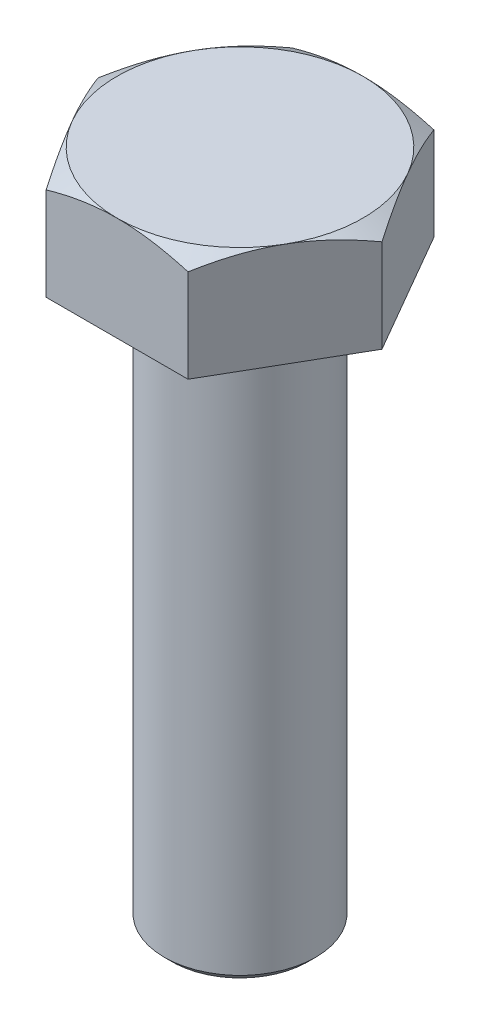
ISO-10303-21;
HEADER;
FILE_DESCRIPTION(('STEP AP214'),'2;1');
FILE_NAME('part.step','',(''),(''),'','','');
FILE_SCHEMA(('AUTOMOTIVE_DESIGN { 1 0 10303 214 1 1 1 1 }'));
ENDSEC;
DATA;
#1=APPLICATION_CONTEXT('core data for automotive mechanical design processes');
#2=APPLICATION_PROTOCOL_DEFINITION('international standard','automotive_design',2000,#1);
#3=PRODUCT_CONTEXT('',#1,'mechanical');
#4=PRODUCT('Part','Part','',(#3));
#5=PRODUCT_RELATED_PRODUCT_CATEGORY('part','',(#4));
#6=PRODUCT_DEFINITION_FORMATION('','',#4);
#7=PRODUCT_DEFINITION_CONTEXT('part definition',#1,'design');
#8=PRODUCT_DEFINITION('design','',#6,#7);
#9=PRODUCT_DEFINITION_SHAPE('','',#8);
#10=(LENGTH_UNIT() NAMED_UNIT(*) SI_UNIT(.MILLI.,.METRE.));
#11=(NAMED_UNIT(*) PLANE_ANGLE_UNIT() SI_UNIT($,.RADIAN.));
#12=(NAMED_UNIT(*) SI_UNIT($,.STERADIAN.) SOLID_ANGLE_UNIT());
#13=UNCERTAINTY_MEASURE_WITH_UNIT(LENGTH_MEASURE(1.E-05),#10,'distance_accuracy_value','');
#14=(GEOMETRIC_REPRESENTATION_CONTEXT(3) GLOBAL_UNCERTAINTY_ASSIGNED_CONTEXT((#13)) GLOBAL_UNIT_ASSIGNED_CONTEXT((#10,
#11,#12)) REPRESENTATION_CONTEXT('',''));
#15=CARTESIAN_POINT('',(0.,0.,0.));
#16=DIRECTION('',(0.,0.,1.));
#17=DIRECTION('',(1.,0.,0.));
#18=AXIS2_PLACEMENT_3D('',#15,#16,#17);
#19=CARTESIAN_POINT('',(-7.50555349946513,5.5,0.));
#20=DIRECTION('',(0.866025403784439,0.,-0.5));
#21=DIRECTION('',(-0.5,0.,-0.866025403784439));
#22=AXIS2_PLACEMENT_3D('',#19,#20,#21);
#23=PLANE('',#22);
#24=DIRECTION('',(0.,-1.,0.));
#25=VECTOR('',#24,1.);
#26=CARTESIAN_POINT('',(-3.75277674973257,5.5,6.5));
#27=LINE('',#26,#25);
#28=CARTESIAN_POINT('',(-3.75277674973257,4.91944341639923,6.5));
#29=VERTEX_POINT('',#28);
#30=CARTESIAN_POINT('',(-3.75277674973257,0.,6.5));
#31=VERTEX_POINT('',#30);
#32=EDGE_CURVE('E215',#29,#31,#27,.T.);
#33=ORIENTED_EDGE('',*,*,#32,.F.);
#34=CARTESIAN_POINT('',(-3.75266127967873,4.91937674819413,6.5002));
#35=CARTESIAN_POINT('',(-3.8351516191275,4.96699557692451,6.35732254094112));
#36=CARTESIAN_POINT('',(-3.91794952254312,5.01245329939729,6.21391236546509));
#37=CARTESIAN_POINT('',(-4.08421773795795,5.09845131797695,5.9259273686828));
#38=CARTESIAN_POINT('',(-4.16768832359105,5.13898949277197,5.78135207342873));
#39=CARTESIAN_POINT('',(-4.41943655294051,5.25242899887679,5.34531134947996));
#40=CARTESIAN_POINT('',(-4.58870793403689,5.31695219287126,5.05212471715368));
#41=CARTESIAN_POINT('',(-4.84201947708215,5.39261341645251,4.61337625445562));
#42=CARTESIAN_POINT('',(-4.92530276780316,5.41416714354301,4.46912536350531));
#43=CARTESIAN_POINT('',(-5.09224566542477,5.45030968539388,4.17997178286191));
#44=CARTESIAN_POINT('',(-5.17590523841627,5.46489911554033,4.03506915190111));
#45=CARTESIAN_POINT('',(-5.34336968579964,5.48674124749265,3.74501222057168));
#46=CARTESIAN_POINT('',(-5.427174286676,5.49400227567789,3.59985839394579));
#47=CARTESIAN_POINT('',(-5.59485627940484,5.50103969741777,3.30942466302505));
#48=CARTESIAN_POINT('',(-5.6787336689286,5.5008163221878,3.16414476276364));
#49=CARTESIAN_POINT('',(-5.90853103021317,5.48991654148483,2.7661240575735));
#50=CARTESIAN_POINT('',(-6.05437578112763,5.47161818213059,2.51351353897243));
#51=CARTESIAN_POINT('',(-6.34509659313134,5.41359365854233,2.00997032176432));
#52=CARTESIAN_POINT('',(-6.48997163178544,5.37384766146176,1.75903939406691));
#53=CARTESIAN_POINT('',(-6.78127752911038,5.27449409679785,1.25448277935568));
#54=CARTESIAN_POINT('',(-6.92767163007067,5.21446557436197,1.00092075856408));
#55=CARTESIAN_POINT('',(-7.21827667013276,5.07822500749013,0.497578064240954));
#56=CARTESIAN_POINT('',(-7.36249133098588,5.0020449658364,0.247790944447035));
#57=CARTESIAN_POINT('',(-7.50566896951897,4.91937674819413,-0.000200000000000198));
#58=B_SPLINE_CURVE_WITH_KNOTS('',3,(#34,#35,#36,#37,#38,#39,#40,#41,#42,#43,#44,#45,#46,#47,#48,
#49,#50,#51,#52,#53,#54,#55,#56,#57),.UNSPECIFIED.,.F.,.F.,(4,2,2,2,2,2,2,2,2,2,2,4),(0.,
0.515105052395589,1.03043143507525,2.06322554824263,2.56697389547997,3.07067772176454,
3.57380860368928,4.0769239424252,4.9527935470566,5.82947446853466,6.72559912449736,
7.61996451221046),.UNSPECIFIED.);
#59=CARTESIAN_POINT('',(-5.62916512459885,5.5,3.25));
#60=VERTEX_POINT('',#59);
#61=EDGE_CURVE('E109',#29,#60,#58,.T.);
#62=ORIENTED_EDGE('',*,*,#61,.T.);
#63=CARTESIAN_POINT('',(-7.50555349946513,4.91944341639923,0.));
#64=VERTEX_POINT('',#63);
#65=EDGE_CURVE('E48',#60,#64,#58,.T.);
#66=ORIENTED_EDGE('',*,*,#65,.T.);
#67=DIRECTION('',(0.,-1.,0.));
#68=VECTOR('',#67,1.);
#69=CARTESIAN_POINT('',(-7.50555349946513,5.5,0.));
#70=LINE('',#69,#68);
#71=CARTESIAN_POINT('',(-7.50555349946513,0.,0.));
#72=VERTEX_POINT('',#71);
#73=EDGE_CURVE('E210',#64,#72,#70,.T.);
#74=ORIENTED_EDGE('',*,*,#73,.T.);
#75=DIRECTION('',(0.5,0.,0.866025403784439));
#76=VECTOR('',#75,1.);
#77=CARTESIAN_POINT('',(-7.50555349946513,0.,0.));
#78=LINE('',#77,#76);
#79=EDGE_CURVE('E258',#72,#31,#78,.T.);
#80=ORIENTED_EDGE('',*,*,#79,.T.);
#81=EDGE_LOOP('',(#33,#62,#66,#74,#80));
#82=FACE_BOUND('',#81,.T.);
#83=ADVANCED_FACE('F32',(#82),#23,.F.);
#84=CARTESIAN_POINT('',(-3.75277674973257,5.5,6.5));
#85=DIRECTION('',(0.,0.,-1.));
#86=DIRECTION('',(-1.,0.,0.));
#87=AXIS2_PLACEMENT_3D('',#84,#85,#86);
#88=PLANE('',#87);
#89=DIRECTION('',(0.,-1.,0.));
#90=VECTOR('',#89,1.);
#91=CARTESIAN_POINT('',(3.75277674973256,5.5,6.5));
#92=LINE('',#91,#90);
#93=CARTESIAN_POINT('',(3.75277674973256,4.91944341639923,6.5));
#94=VERTEX_POINT('',#93);
#95=CARTESIAN_POINT('',(3.75277674973256,0.,6.5));
#96=VERTEX_POINT('',#95);
#97=EDGE_CURVE('E132',#94,#96,#92,.T.);
#98=ORIENTED_EDGE('',*,*,#97,.F.);
#99=CARTESIAN_POINT('',(-10.2569811581145,2.24193603747567,6.5));
#100=CARTESIAN_POINT('',(-9.97152071241616,2.3811107260564,6.5));
#101=CARTESIAN_POINT('',(-9.68542356184238,2.51900094901753,6.5));
#102=CARTESIAN_POINT('',(-9.11161784295799,2.79149330549847,6.5));
#103=CARTESIAN_POINT('',(-8.82390904413647,2.92609495309311,6.5));
#104=CARTESIAN_POINT('',(-8.24514298507913,3.19193071680512,6.5));
#105=CARTESIAN_POINT('',(-7.95407611612472,3.32314398250626,6.5));
#106=CARTESIAN_POINT('',(-7.36968788076824,3.58043061920346,6.5));
#107=CARTESIAN_POINT('',(-7.07636661672063,3.70650422193208,6.5));
#108=CARTESIAN_POINT('',(-6.47695243590429,3.95634962963028,6.5));
#109=CARTESIAN_POINT('',(-6.17076515690619,4.07989623181881,6.5));
#110=CARTESIAN_POINT('',(-5.55487406233115,4.31805921645203,6.5));
#111=CARTESIAN_POINT('',(-5.24516986632689,4.43267462205472,6.5));
#112=CARTESIAN_POINT('',(-4.62227782859011,4.65009578142601,6.5));
#113=CARTESIAN_POINT('',(-4.30909789509134,4.75292397660159,6.5));
#114=CARTESIAN_POINT('',(-3.67824562128558,4.94358764514793,6.5));
#115=CARTESIAN_POINT('',(-3.36057467243283,5.03142765666299,6.5));
#116=CARTESIAN_POINT('',(-2.72233834322949,5.18755382777747,6.5));
#117=CARTESIAN_POINT('',(-2.40180034569074,5.25595018727147,6.5));
#118=CARTESIAN_POINT('',(-1.75651446089022,5.36942603167775,6.5));
#119=CARTESIAN_POINT('',(-1.43176704086645,5.41450808209729,6.5));
#120=CARTESIAN_POINT('',(-0.944948454223624,5.461661214171,6.5));
#121=CARTESIAN_POINT('',(-0.783829121847983,5.47395132499534,6.5));
#122=CARTESIAN_POINT('',(-0.461207643956623,5.49170569978557,6.5));
#123=CARTESIAN_POINT('',(-0.299705505129459,5.49717008214536,6.5));
#124=CARTESIAN_POINT('',(0.0233847507870482,5.5011346278911,6.5));
#125=CARTESIAN_POINT('',(0.184972868293144,5.49963475720699,6.5));
#126=CARTESIAN_POINT('',(0.507938624093218,5.48971122482812,6.5));
#127=CARTESIAN_POINT('',(0.669316252561588,5.48128725074041,6.5));
#128=CARTESIAN_POINT('',(1.05186984116705,5.45329242106935,6.5));
#129=CARTESIAN_POINT('',(1.27283197400475,5.43073050256622,6.5));
#130=CARTESIAN_POINT('',(1.7132204140684,5.3738163776728,6.5));
#131=CARTESIAN_POINT('',(1.93264652850567,5.33946271742277,6.5));
#132=CARTESIAN_POINT('',(2.5883051727522,5.22052726609204,6.5));
#133=CARTESIAN_POINT('',(3.02170523211321,5.12008872652817,6.5));
#134=CARTESIAN_POINT('',(3.67013226717754,4.94455981713671,6.5));
#135=CARTESIAN_POINT('',(3.88848282118767,4.88102933682177,6.5));
#136=CARTESIAN_POINT('',(4.32306650384689,4.74703310722731,6.5));
#137=CARTESIAN_POINT('',(4.53929961593337,4.67656730374728,6.5));
#138=CARTESIAN_POINT('',(4.96971257662596,4.52985876558726,6.5));
#139=CARTESIAN_POINT('',(5.18389297179377,4.45361761968216,6.5));
#140=CARTESIAN_POINT('',(5.6104545614491,4.29628899088769,6.5));
#141=CARTESIAN_POINT('',(5.82283579881262,4.21520162386241,6.5));
#142=CARTESIAN_POINT('',(6.39971429617937,3.98860660424242,6.5));
#143=CARTESIAN_POINT('',(6.76263661829908,3.83909295608597,6.5));
#144=CARTESIAN_POINT('',(7.48468774337365,3.53113759508195,6.5));
#145=CARTESIAN_POINT('',(7.84381610059947,3.37269484676216,6.5));
#146=CARTESIAN_POINT('',(8.55916159829325,3.04901713597798,6.5));
#147=CARTESIAN_POINT('',(8.91537751556308,2.88377947937219,6.5));
#148=CARTESIAN_POINT('',(9.62534833847638,2.54815535258062,6.5));
#149=CARTESIAN_POINT('',(9.97910334857499,2.37776910259174,6.5));
#150=CARTESIAN_POINT('',(10.6852305173667,2.03269430481302,6.5));
#151=CARTESIAN_POINT('',(11.0375994152368,1.8579990986413,6.5));
#152=CARTESIAN_POINT('',(11.7407393222631,1.50541985688161,6.5));
#153=CARTESIAN_POINT('',(12.0915103173944,1.32753579337205,6.5));
#154=CARTESIAN_POINT('',(12.7916615383492,0.969252159931259,6.5));
#155=CARTESIAN_POINT('',(13.1410420664163,0.788853179925624,6.5));
#156=CARTESIAN_POINT('',(13.8387213322387,0.425974163130967,6.5));
#157=CARTESIAN_POINT('',(14.1870200656207,0.243494117942694,6.5));
#158=CARTESIAN_POINT('',(15.155733527584,-0.26705759309495,6.5));
#159=CARTESIAN_POINT('',(15.7751675029438,-0.596989701899075,6.5));
#160=CARTESIAN_POINT('',(17.0119683749366,-1.26079214349704,6.5));
#161=CARTESIAN_POINT('',(17.6293351357113,-1.59466272885168,6.5));
#162=CARTESIAN_POINT('',(18.8603569569557,-2.26417235282034,6.5));
#163=CARTESIAN_POINT('',(19.4740174800252,-2.59980135723137,6.5));
#164=CARTESIAN_POINT('',(20.7000468035059,-3.27329318403227,6.5));
#165=CARTESIAN_POINT('',(21.3124157052552,-3.61115582187028,6.5));
#166=CARTESIAN_POINT('',(21.9243328758051,-3.94982870082288,6.5));
#167=B_SPLINE_CURVE_WITH_KNOTS('',3,(#99,#100,#101,#102,#103,#104,#105,#106,#107,#108,#109,#110,
#111,#112,#113,#114,#115,#116,#117,#118,#119,#120,#121,#122,#123,#124,#125,#126,#127,#128,#129,
#130,#131,#132,#133,#134,#135,#136,#137,#138,#139,#140,#141,#142,#143,#144,#145,#146,#147,#148,
#149,#150,#151,#152,#153,#154,#155,#156,#157,#158,#159,#160,#161,#162,#163,#164,#165,#166),
.UNSPECIFIED.,.F.,.F.,(4,2,2,2,2,2,2,2,2,2,2,2,2,2,2,2,2,2,2,2,2,2,2,2,2,2,2,2,2,2,2,2,2,4),(0.,
0.952751787332591,1.9056435136375,2.86343013145144,3.82117351756361,4.81158577818519,
5.80210621269642,6.79070834510604,7.77901061389342,8.76159445926533,9.74407015806365,
10.2287097693575,10.7133409743435,11.1979745502116,11.6826299923647,12.3485906881873,
13.0146335229724,14.3473568128282,15.0295101923764,15.7116689034696,16.3936406320568,
17.0755960624924,18.2529569542351,19.4304546619183,20.6084238291587,21.7863426877004,
22.96621250542,24.1460926591093,25.3257005550144,26.5053132135446,28.6107561283309,
30.7163347998396,32.814670367307,34.9128346761895),.UNSPECIFIED.);
#168=CARTESIAN_POINT('',(0.,5.5,6.5));
#169=VERTEX_POINT('',#168);
#170=EDGE_CURVE('E113',#94,#169,#167,.F.);
#171=ORIENTED_EDGE('',*,*,#170,.T.);
#172=EDGE_CURVE('E103',#169,#29,#167,.F.);
#173=ORIENTED_EDGE('',*,*,#172,.T.);
#174=ORIENTED_EDGE('',*,*,#32,.T.);
#175=DIRECTION('',(1.,0.,0.));
#176=VECTOR('',#175,1.);
#177=CARTESIAN_POINT('',(-3.75277674973257,0.,6.5));
#178=LINE('',#177,#176);
#179=EDGE_CURVE('E262',#31,#96,#178,.T.);
#180=ORIENTED_EDGE('',*,*,#179,.T.);
#181=EDGE_LOOP('',(#98,#171,#173,#174,#180));
#182=FACE_BOUND('',#181,.T.);
#183=ADVANCED_FACE('F130',(#182),#88,.F.);
#184=CARTESIAN_POINT('',(3.75277674973256,5.5,6.5));
#185=DIRECTION('',(-0.866025403784439,0.,-0.5));
#186=DIRECTION('',(-0.5,0.,0.866025403784439));
#187=AXIS2_PLACEMENT_3D('',#184,#185,#186);
#188=PLANE('',#187);
#189=DIRECTION('',(0.,-1.,0.));
#190=VECTOR('',#189,1.);
#191=CARTESIAN_POINT('',(7.50555349946513,5.5,0.));
#192=LINE('',#191,#190);
#193=CARTESIAN_POINT('',(7.50555349946513,4.91944341639924,0.));
#194=VERTEX_POINT('',#193);
#195=CARTESIAN_POINT('',(7.50555349946513,0.,0.));
#196=VERTEX_POINT('',#195);
#197=EDGE_CURVE('E206',#194,#196,#192,.T.);
#198=ORIENTED_EDGE('',*,*,#197,.F.);
#199=CARTESIAN_POINT('',(7.50566896951897,4.91937674819413,-0.000200000000002157));
#200=CARTESIAN_POINT('',(7.42317863007019,4.96699557692451,0.142677459058878));
#201=CARTESIAN_POINT('',(7.34038072665458,5.01245329939729,0.28608763453491));
#202=CARTESIAN_POINT('',(7.17411251123975,5.09845131797695,0.574072631317192));
#203=CARTESIAN_POINT('',(7.09064192560665,5.13898949277197,0.718647926571262));
#204=CARTESIAN_POINT('',(6.83889369625718,5.25242899887679,1.15468865052003));
#205=CARTESIAN_POINT('',(6.6696223151608,5.31695219287126,1.44787528284632));
#206=CARTESIAN_POINT('',(6.41631077211555,5.39261341645251,1.88662374554437));
#207=CARTESIAN_POINT('',(6.33302748139454,5.41416714354301,2.03087463649469));
#208=CARTESIAN_POINT('',(6.16608458377293,5.45030968539388,2.32002821713809));
#209=CARTESIAN_POINT('',(6.08242501078142,5.46489911554034,2.46493084809889));
#210=CARTESIAN_POINT('',(5.91496056339806,5.48674124749266,2.75498777942832));
#211=CARTESIAN_POINT('',(5.8311559625217,5.49400227567789,2.90014160605421));
#212=CARTESIAN_POINT('',(5.66347396979286,5.50103969741777,3.19057533697495));
#213=CARTESIAN_POINT('',(5.5795965802691,5.5008163221878,3.33585523723636));
#214=CARTESIAN_POINT('',(5.34979921898453,5.48991654148484,3.7338759424265));
#215=CARTESIAN_POINT('',(5.20395446807006,5.47161818213059,3.98648646102757));
#216=CARTESIAN_POINT('',(4.91323365606635,5.41359365854233,4.49002967823568));
#217=CARTESIAN_POINT('',(4.76835861741225,5.37384766146176,4.74096060593308));
#218=CARTESIAN_POINT('',(4.47705272008731,5.27449409679785,5.24551722064432));
#219=CARTESIAN_POINT('',(4.33065861912702,5.21446557436197,5.49907924143591));
#220=CARTESIAN_POINT('',(4.04005357906493,5.07822500749013,6.00242193575905));
#221=CARTESIAN_POINT('',(3.89583891821181,5.0020449658364,6.25220905555296));
#222=CARTESIAN_POINT('',(3.75266127967873,4.91937674819413,6.5002));
#223=B_SPLINE_CURVE_WITH_KNOTS('',3,(#199,#200,#201,#202,#203,#204,#205,#206,#207,#208,#209,
#210,#211,#212,#213,#214,#215,#216,#217,#218,#219,#220,#221,#222),.UNSPECIFIED.,.F.,.F.,(4,2,2,
2,2,2,2,2,2,2,2,4),(0.,0.515105052395588,1.03043143507525,2.06322554824263,2.56697389547997,
3.07067772176454,3.57380860368928,4.0769239424252,4.9527935470566,5.82947446853467,
6.72559912449737,7.61996451221046),.UNSPECIFIED.);
#224=CARTESIAN_POINT('',(5.62916512459885,5.5,3.25));
#225=VERTEX_POINT('',#224);
#226=EDGE_CURVE('E263',#194,#225,#223,.T.);
#227=ORIENTED_EDGE('',*,*,#226,.T.);
#228=EDGE_CURVE('E121',#225,#94,#223,.T.);
#229=ORIENTED_EDGE('',*,*,#228,.T.);
#230=ORIENTED_EDGE('',*,*,#97,.T.);
#231=DIRECTION('',(0.5,0.,-0.866025403784439));
#232=VECTOR('',#231,1.);
#233=CARTESIAN_POINT('',(3.75277674973256,0.,6.5));
#234=LINE('',#233,#232);
#235=EDGE_CURVE('E264',#96,#196,#234,.T.);
#236=ORIENTED_EDGE('',*,*,#235,.T.);
#237=EDGE_LOOP('',(#198,#227,#229,#230,#236));
#238=FACE_BOUND('',#237,.T.);
#239=ADVANCED_FACE('F158',(#238),#188,.F.);
#240=CARTESIAN_POINT('',(7.50555349946513,5.5,0.));
#241=DIRECTION('',(-0.866025403784438,0.,0.5));
#242=DIRECTION('',(0.5,0.,0.866025403784439));
#243=AXIS2_PLACEMENT_3D('',#240,#241,#242);
#244=PLANE('',#243);
#245=DIRECTION('',(0.,-1.,0.));
#246=VECTOR('',#245,1.);
#247=CARTESIAN_POINT('',(3.75277674973256,5.5,-6.5));
#248=LINE('',#247,#246);
#249=CARTESIAN_POINT('',(3.75277674973256,4.91944341639923,-6.5));
#250=VERTEX_POINT('',#249);
#251=CARTESIAN_POINT('',(3.75277674973256,0.,-6.5));
#252=VERTEX_POINT('',#251);
#253=EDGE_CURVE('E200',#250,#252,#248,.T.);
#254=ORIENTED_EDGE('',*,*,#253,.F.);
#255=CARTESIAN_POINT('',(3.75266127967872,4.91937674819413,-6.5002));
#256=CARTESIAN_POINT('',(3.8351516191275,4.96699557692451,-6.35732254094112));
#257=CARTESIAN_POINT('',(3.91794952254312,5.01245329939729,-6.21391236546509));
#258=CARTESIAN_POINT('',(4.08421773795794,5.09845131797695,-5.9259273686828));
#259=CARTESIAN_POINT('',(4.16768832359105,5.13898949277197,-5.78135207342874));
#260=CARTESIAN_POINT('',(4.41943655294051,5.25242899887679,-5.34531134947996));
#261=CARTESIAN_POINT('',(4.58870793403689,5.31695219287126,-5.05212471715368));
#262=CARTESIAN_POINT('',(4.84201947708215,5.39261341645251,-4.61337625445563));
#263=CARTESIAN_POINT('',(4.92530276780315,5.41416714354301,-4.46912536350531));
#264=CARTESIAN_POINT('',(5.09224566542477,5.45030968539388,-4.17997178286191));
#265=CARTESIAN_POINT('',(5.17590523841627,5.46489911554034,-4.03506915190111));
#266=CARTESIAN_POINT('',(5.34336968579963,5.48674124749266,-3.74501222057168));
#267=CARTESIAN_POINT('',(5.42717428667599,5.49400227567789,-3.59985839394579));
#268=CARTESIAN_POINT('',(5.59485627940483,5.50103969741777,-3.30942466302505));
#269=CARTESIAN_POINT('',(5.6787336689286,5.5008163221878,-3.16414476276364));
#270=CARTESIAN_POINT('',(5.90853103021317,5.48991654148484,-2.76612405757351));
#271=CARTESIAN_POINT('',(6.05437578112763,5.47161818213059,-2.51351353897243));
#272=CARTESIAN_POINT('',(6.34509659313134,5.41359365854233,-2.00997032176432));
#273=CARTESIAN_POINT('',(6.48997163178544,5.37384766146176,-1.75903939406692));
#274=CARTESIAN_POINT('',(6.78127752911038,5.27449409679785,-1.25448277935568));
#275=CARTESIAN_POINT('',(6.92767163007067,5.21446557436197,-1.00092075856409));
#276=CARTESIAN_POINT('',(7.21827667013276,5.07822500749013,-0.497578064240957));
#277=CARTESIAN_POINT('',(7.36249133098588,5.00204496583641,-0.247790944447038));
#278=CARTESIAN_POINT('',(7.50566896951897,4.91937674819413,0.000199999999998293));
#279=B_SPLINE_CURVE_WITH_KNOTS('',3,(#255,#256,#257,#258,#259,#260,#261,#262,#263,#264,#265,
#266,#267,#268,#269,#270,#271,#272,#273,#274,#275,#276,#277,#278),.UNSPECIFIED.,.F.,.F.,(4,2,2,
2,2,2,2,2,2,2,2,4),(0.,0.515105052395588,1.03043143507525,2.06322554824263,2.56697389547997,
3.07067772176454,3.57380860368928,4.0769239424252,4.9527935470566,5.82947446853466,
6.72559912449736,7.61996451221046),.UNSPECIFIED.);
#280=CARTESIAN_POINT('',(5.62916512459885,5.5,-3.25));
#281=VERTEX_POINT('',#280);
#282=EDGE_CURVE('E114',#250,#281,#279,.T.);
#283=ORIENTED_EDGE('',*,*,#282,.T.);
#284=EDGE_CURVE('E133',#281,#194,#279,.T.);
#285=ORIENTED_EDGE('',*,*,#284,.T.);
#286=ORIENTED_EDGE('',*,*,#197,.T.);
#287=DIRECTION('',(-0.5,0.,-0.866025403784439));
#288=VECTOR('',#287,1.);
#289=CARTESIAN_POINT('',(7.50555349946513,0.,0.));
#290=LINE('',#289,#288);
#291=EDGE_CURVE('E202',#196,#252,#290,.T.);
#292=ORIENTED_EDGE('',*,*,#291,.T.);
#293=EDGE_LOOP('',(#254,#283,#285,#286,#292));
#294=FACE_BOUND('',#293,.T.);
#295=ADVANCED_FACE('F186',(#294),#244,.F.);
#296=CARTESIAN_POINT('',(3.75277674973256,5.5,-6.5));
#297=DIRECTION('',(0.,0.,1.));
#298=DIRECTION('',(1.,0.,0.));
#299=AXIS2_PLACEMENT_3D('',#296,#297,#298);
#300=PLANE('',#299);
#301=DIRECTION('',(0.,-1.,0.));
#302=VECTOR('',#301,1.);
#303=CARTESIAN_POINT('',(-3.75277674973257,5.5,-6.5));
#304=LINE('',#303,#302);
#305=CARTESIAN_POINT('',(-3.75277674973257,4.91944341639923,-6.5));
#306=VERTEX_POINT('',#305);
#307=CARTESIAN_POINT('',(-3.75277674973257,0.,-6.5));
#308=VERTEX_POINT('',#307);
#309=EDGE_CURVE('E207',#306,#308,#304,.T.);
#310=ORIENTED_EDGE('',*,*,#309,.F.);
#311=CARTESIAN_POINT('',(-10.2569811581145,2.24193603747566,-6.5));
#312=CARTESIAN_POINT('',(-9.97152071241616,2.3811107260564,-6.5));
#313=CARTESIAN_POINT('',(-9.68542356184238,2.51900094901753,-6.5));
#314=CARTESIAN_POINT('',(-9.11161784295799,2.79149330549847,-6.5));
#315=CARTESIAN_POINT('',(-8.82390904413647,2.92609495309311,-6.5));
#316=CARTESIAN_POINT('',(-8.24514298507913,3.19193071680512,-6.5));
#317=CARTESIAN_POINT('',(-7.95407611612472,3.32314398250626,-6.5));
#318=CARTESIAN_POINT('',(-7.36968788076824,3.58043061920346,-6.5));
#319=CARTESIAN_POINT('',(-7.07636661672063,3.70650422193208,-6.5));
#320=CARTESIAN_POINT('',(-6.47695243590429,3.95634962963027,-6.5));
#321=CARTESIAN_POINT('',(-6.17076515690619,4.07989623181881,-6.5));
#322=CARTESIAN_POINT('',(-5.55487406233115,4.31805921645203,-6.5));
#323=CARTESIAN_POINT('',(-5.2451698663269,4.43267462205471,-6.5));
#324=CARTESIAN_POINT('',(-4.62227782859012,4.65009578142601,-6.5));
#325=CARTESIAN_POINT('',(-4.30909789509134,4.75292397660159,-6.5));
#326=CARTESIAN_POINT('',(-3.67824562128559,4.94358764514793,-6.5));
#327=CARTESIAN_POINT('',(-3.36057467243283,5.03142765666299,-6.5));
#328=CARTESIAN_POINT('',(-2.72233834322949,5.18755382777747,-6.5));
#329=CARTESIAN_POINT('',(-2.40180034569074,5.25595018727147,-6.5));
#330=CARTESIAN_POINT('',(-1.75651446089022,5.36942603167775,-6.5));
#331=CARTESIAN_POINT('',(-1.43176704086646,5.41450808209729,-6.5));
#332=CARTESIAN_POINT('',(-0.944948454223626,5.461661214171,-6.5));
#333=CARTESIAN_POINT('',(-0.783829121847985,5.47395132499534,-6.5));
#334=CARTESIAN_POINT('',(-0.461207643956625,5.49170569978557,-6.5));
#335=CARTESIAN_POINT('',(-0.29970550512946,5.49717008214536,-6.5));
#336=CARTESIAN_POINT('',(0.0233847507870477,5.5011346278911,-6.5));
#337=CARTESIAN_POINT('',(0.184972868293143,5.49963475720699,-6.5));
#338=CARTESIAN_POINT('',(0.507938624093217,5.48971122482812,-6.5));
#339=CARTESIAN_POINT('',(0.669316252561588,5.48128725074041,-6.5));
#340=CARTESIAN_POINT('',(1.05186984116705,5.45329242106935,-6.5));
#341=CARTESIAN_POINT('',(1.27283197400475,5.43073050256622,-6.5));
#342=CARTESIAN_POINT('',(1.7132204140684,5.3738163776728,-6.5));
#343=CARTESIAN_POINT('',(1.93264652850567,5.33946271742277,-6.5));
#344=CARTESIAN_POINT('',(2.5883051727522,5.22052726609204,-6.5));
#345=CARTESIAN_POINT('',(3.02170523211321,5.12008872652817,-6.5));
#346=CARTESIAN_POINT('',(3.67013226717754,4.94455981713671,-6.5));
#347=CARTESIAN_POINT('',(3.88848282118766,4.88102933682177,-6.5));
#348=CARTESIAN_POINT('',(4.32306650384689,4.74703310722731,-6.5));
#349=CARTESIAN_POINT('',(4.53929961593337,4.67656730374728,-6.5));
#350=CARTESIAN_POINT('',(4.96971257662595,4.52985876558726,-6.5));
#351=CARTESIAN_POINT('',(5.18389297179376,4.45361761968216,-6.5));
#352=CARTESIAN_POINT('',(5.6104545614491,4.29628899088769,-6.5));
#353=CARTESIAN_POINT('',(5.82283579881262,4.21520162386241,-6.5));
#354=CARTESIAN_POINT('',(6.39971429617937,3.98860660424242,-6.5));
#355=CARTESIAN_POINT('',(6.76263661829908,3.83909295608598,-6.5));
#356=CARTESIAN_POINT('',(7.48468774337364,3.53113759508195,-6.5));
#357=CARTESIAN_POINT('',(7.84381610059947,3.37269484676216,-6.5));
#358=CARTESIAN_POINT('',(8.55916159829325,3.04901713597798,-6.5));
#359=CARTESIAN_POINT('',(8.91537751556308,2.88377947937219,-6.5));
#360=CARTESIAN_POINT('',(9.62534833847638,2.54815535258062,-6.5));
#361=CARTESIAN_POINT('',(9.97910334857499,2.37776910259174,-6.5));
#362=CARTESIAN_POINT('',(10.6852305173667,2.03269430481302,-6.5));
#363=CARTESIAN_POINT('',(11.0375994152368,1.8579990986413,-6.5));
#364=CARTESIAN_POINT('',(11.7407393222631,1.50541985688161,-6.5));
#365=CARTESIAN_POINT('',(12.0915103173944,1.32753579337206,-6.5));
#366=CARTESIAN_POINT('',(12.7916615383492,0.969252159931262,-6.5));
#367=CARTESIAN_POINT('',(13.1410420664163,0.788853179925627,-6.5));
#368=CARTESIAN_POINT('',(13.8387213322387,0.425974163130971,-6.5));
#369=CARTESIAN_POINT('',(14.1870200656207,0.243494117942697,-6.5));
#370=CARTESIAN_POINT('',(15.155733527584,-0.267057593094945,-6.5));
#371=CARTESIAN_POINT('',(15.7751675029438,-0.596989701899072,-6.5));
#372=CARTESIAN_POINT('',(17.0119683749366,-1.26079214349704,-6.5));
#373=CARTESIAN_POINT('',(17.6293351357113,-1.59466272885168,-6.5));
#374=CARTESIAN_POINT('',(18.8603569569557,-2.26417235282033,-6.5));
#375=CARTESIAN_POINT('',(19.4740174800252,-2.59980135723136,-6.5));
#376=CARTESIAN_POINT('',(20.7000468035059,-3.27329318403227,-6.5));
#377=CARTESIAN_POINT('',(21.3124157052552,-3.61115582187027,-6.5));
#378=CARTESIAN_POINT('',(21.9243328758051,-3.94982870082287,-6.5));
#379=B_SPLINE_CURVE_WITH_KNOTS('',3,(#311,#312,#313,#314,#315,#316,#317,#318,#319,#320,#321,
#322,#323,#324,#325,#326,#327,#328,#329,#330,#331,#332,#333,#334,#335,#336,#337,#338,#339,#340,
#341,#342,#343,#344,#345,#346,#347,#348,#349,#350,#351,#352,#353,#354,#355,#356,#357,#358,#359,
#360,#361,#362,#363,#364,#365,#366,#367,#368,#369,#370,#371,#372,#373,#374,#375,#376,#377,#378),
.UNSPECIFIED.,.F.,.F.,(4,2,2,2,2,2,2,2,2,2,2,2,2,2,2,2,2,2,2,2,2,2,2,2,2,2,2,2,2,2,2,2,2,4),(0.,
0.952751787332594,1.9056435136375,2.86343013145144,3.82117351756361,4.81158577818519,
5.80210621269642,6.79070834510604,7.77901061389342,8.76159445926533,9.74407015806365,
10.2287097693575,10.7133409743435,11.1979745502116,11.6826299923647,12.3485906881873,
13.0146335229724,14.3473568128282,15.0295101923764,15.7116689034696,16.3936406320568,
17.0755960624924,18.2529569542351,19.4304546619183,20.6084238291587,21.7863426877004,
22.96621250542,24.1460926591092,25.3257005550144,26.5053132135446,28.6107561283309,
30.7163347998396,32.814670367307,34.9128346761895),.UNSPECIFIED.);
#380=CARTESIAN_POINT('',(0.,5.5,-6.5));
#381=VERTEX_POINT('',#380);
#382=EDGE_CURVE('E168',#306,#381,#379,.T.);
#383=ORIENTED_EDGE('',*,*,#382,.T.);
#384=EDGE_CURVE('E176',#381,#250,#379,.T.);
#385=ORIENTED_EDGE('',*,*,#384,.T.);
#386=ORIENTED_EDGE('',*,*,#253,.T.);
#387=DIRECTION('',(-1.,0.,0.));
#388=VECTOR('',#387,1.);
#389=CARTESIAN_POINT('',(3.75277674973256,0.,-6.5));
#390=LINE('',#389,#388);
#391=EDGE_CURVE('E270',#252,#308,#390,.T.);
#392=ORIENTED_EDGE('',*,*,#391,.T.);
#393=EDGE_LOOP('',(#310,#383,#385,#386,#392));
#394=FACE_BOUND('',#393,.T.);
#395=ADVANCED_FACE('F182',(#394),#300,.F.);
#396=CARTESIAN_POINT('',(-3.75277674973257,5.5,-6.5));
#397=DIRECTION('',(0.866025403784439,0.,0.5));
#398=DIRECTION('',(0.5,0.,-0.866025403784439));
#399=AXIS2_PLACEMENT_3D('',#396,#397,#398);
#400=PLANE('',#399);
#401=ORIENTED_EDGE('',*,*,#73,.F.);
#402=CARTESIAN_POINT('',(-7.50566896951897,4.91937674819413,0.0002));
#403=CARTESIAN_POINT('',(-7.42317863007019,4.96699557692451,-0.14267745905888));
#404=CARTESIAN_POINT('',(-7.34038072665458,5.01245329939729,-0.286087634534913));
#405=CARTESIAN_POINT('',(-7.17411251123975,5.09845131797695,-0.574072631317196));
#406=CARTESIAN_POINT('',(-7.09064192560665,5.13898949277197,-0.718647926571265));
#407=CARTESIAN_POINT('',(-6.83889369625718,5.25242899887679,-1.15468865052004));
#408=CARTESIAN_POINT('',(-6.6696223151608,5.31695219287126,-1.44787528284632));
#409=CARTESIAN_POINT('',(-6.41631077211555,5.39261341645251,-1.88662374554438));
#410=CARTESIAN_POINT('',(-6.33302748139454,5.41416714354301,-2.03087463649469));
#411=CARTESIAN_POINT('',(-6.16608458377293,5.45030968539388,-2.32002821713809));
#412=CARTESIAN_POINT('',(-6.08242501078142,5.46489911554033,-2.46493084809889));
#413=CARTESIAN_POINT('',(-5.91496056339806,5.48674124749265,-2.75498777942832));
#414=CARTESIAN_POINT('',(-5.8311559625217,5.49400227567789,-2.90014160605421));
#415=CARTESIAN_POINT('',(-5.66347396979286,5.50103969741777,-3.19057533697495));
#416=CARTESIAN_POINT('',(-5.5795965802691,5.5008163221878,-3.33585523723636));
#417=CARTESIAN_POINT('',(-5.34979921898453,5.48991654148483,-3.7338759424265));
#418=CARTESIAN_POINT('',(-5.20395446807006,5.47161818213059,-3.98648646102757));
#419=CARTESIAN_POINT('',(-4.91323365606635,5.41359365854232,-4.49002967823568));
#420=CARTESIAN_POINT('',(-4.76835861741225,5.37384766146175,-4.74096060593309));
#421=CARTESIAN_POINT('',(-4.47705272008731,5.27449409679785,-5.24551722064432));
#422=CARTESIAN_POINT('',(-4.33065861912702,5.21446557436197,-5.49907924143591));
#423=CARTESIAN_POINT('',(-4.04005357906493,5.07822500749013,-6.00242193575905));
#424=CARTESIAN_POINT('',(-3.89583891821181,5.0020449658364,-6.25220905555296));
#425=CARTESIAN_POINT('',(-3.75266127967873,4.91937674819413,-6.5002));
#426=B_SPLINE_CURVE_WITH_KNOTS('',3,(#402,#403,#404,#405,#406,#407,#408,#409,#410,#411,#412,
#413,#414,#415,#416,#417,#418,#419,#420,#421,#422,#423,#424,#425),.UNSPECIFIED.,.F.,.F.,(4,2,2,
2,2,2,2,2,2,2,2,4),(0.,0.515105052395588,1.03043143507525,2.06322554824263,2.56697389547997,
3.07067772176454,3.57380860368928,4.07692394242521,4.95279354705661,5.82947446853467,
6.72559912449736,7.61996451221046),.UNSPECIFIED.);
#427=CARTESIAN_POINT('',(-5.62916512459885,5.5,-3.25));
#428=VERTEX_POINT('',#427);
#429=EDGE_CURVE('E175',#64,#428,#426,.T.);
#430=ORIENTED_EDGE('',*,*,#429,.T.);
#431=EDGE_CURVE('E55',#428,#306,#426,.T.);
#432=ORIENTED_EDGE('',*,*,#431,.T.);
#433=ORIENTED_EDGE('',*,*,#309,.T.);
#434=DIRECTION('',(-0.5,0.,0.866025403784439));
#435=VECTOR('',#434,1.);
#436=CARTESIAN_POINT('',(-3.75277674973257,0.,-6.5));
#437=LINE('',#436,#435);
#438=EDGE_CURVE('E260',#308,#72,#437,.T.);
#439=ORIENTED_EDGE('',*,*,#438,.T.);
#440=EDGE_LOOP('',(#401,#430,#432,#433,#439));
#441=FACE_BOUND('',#440,.T.);
#442=ADVANCED_FACE('F185',(#441),#400,.F.);
#443=CARTESIAN_POINT('',(0.,0.,0.));
#444=DIRECTION('',(0.,1.,0.));
#445=DIRECTION('',(0.,0.,1.));
#446=AXIS2_PLACEMENT_3D('',#443,#444,#445);
#447=PLANE('',#446);
#448=CARTESIAN_POINT('',(0.,0.,0.));
#449=DIRECTION('',(0.,1.,0.));
#450=DIRECTION('',(0.,0.,1.));
#451=AXIS2_PLACEMENT_3D('',#448,#449,#450);
#452=CIRCLE('',#451,4.4);
#453=CARTESIAN_POINT('',(0.,0.,4.4));
#454=VERTEX_POINT('',#453);
#455=EDGE_CURVE('E220',#454,#454,#452,.T.);
#456=ORIENTED_EDGE('',*,*,#455,.T.);
#457=EDGE_LOOP('',(#456));
#458=FACE_BOUND('',#457,.T.);
#459=ORIENTED_EDGE('',*,*,#79,.F.);
#460=ORIENTED_EDGE('',*,*,#438,.F.);
#461=ORIENTED_EDGE('',*,*,#391,.F.);
#462=ORIENTED_EDGE('',*,*,#291,.F.);
#463=ORIENTED_EDGE('',*,*,#235,.F.);
#464=ORIENTED_EDGE('',*,*,#179,.F.);
#465=EDGE_LOOP('',(#459,#460,#461,#462,#463,#464));
#466=FACE_BOUND('',#465,.T.);
#467=ADVANCED_FACE('F242',(#458,#466),#447,.F.);
#468=CARTESIAN_POINT('',(0.,-30.,0.));
#469=DIRECTION('',(0.,1.,0.));
#470=DIRECTION('',(0.,0.,1.));
#471=AXIS2_PLACEMENT_3D('',#468,#469,#470);
#472=CYLINDRICAL_SURFACE('',#471,4.);
#473=CARTESIAN_POINT('',(0.,-29.6,0.));
#474=DIRECTION('',(0.,-1.,0.));
#475=DIRECTION('',(0.,0.,-1.));
#476=AXIS2_PLACEMENT_3D('',#473,#474,#475);
#477=CIRCLE('',#476,4.);
#478=CARTESIAN_POINT('',(0.,-29.6,-4.));
#479=VERTEX_POINT('',#478);
#480=EDGE_CURVE('E126',#479,#479,#477,.F.);
#481=ORIENTED_EDGE('',*,*,#480,.T.);
#482=EDGE_LOOP('',(#481));
#483=FACE_BOUND('',#482,.T.);
#484=CARTESIAN_POINT('',(0.,-0.400000000000001,0.));
#485=DIRECTION('',(0.,1.,0.));
#486=DIRECTION('',(0.,0.,1.));
#487=AXIS2_PLACEMENT_3D('',#484,#485,#486);
#488=CIRCLE('',#487,4.);
#489=CARTESIAN_POINT('',(0.,-0.400000000000001,4.));
#490=VERTEX_POINT('',#489);
#491=EDGE_CURVE('E217',#490,#490,#488,.F.);
#492=ORIENTED_EDGE('',*,*,#491,.T.);
#493=EDGE_LOOP('',(#492));
#494=FACE_BOUND('',#493,.T.);
#495=ADVANCED_FACE('F228',(#483,#494),#472,.T.);
#496=CARTESIAN_POINT('',(0.,-30.,0.));
#497=DIRECTION('',(0.,-1.,0.));
#498=DIRECTION('',(0.,0.,-1.));
#499=AXIS2_PLACEMENT_3D('',#496,#497,#498);
#500=PLANE('',#499);
#501=CARTESIAN_POINT('',(0.,-30.,0.));
#502=DIRECTION('',(0.,-1.,0.));
#503=DIRECTION('',(0.,0.,-1.));
#504=AXIS2_PLACEMENT_3D('',#501,#502,#503);
#505=CIRCLE('',#504,3.6);
#506=CARTESIAN_POINT('',(0.,-30.,-3.6));
#507=VERTEX_POINT('',#506);
#508=EDGE_CURVE('E223',#507,#507,#505,.T.);
#509=ORIENTED_EDGE('',*,*,#508,.T.);
#510=EDGE_LOOP('',(#509));
#511=FACE_BOUND('',#510,.T.);
#512=ADVANCED_FACE('F235',(#511),#500,.T.);
#513=CARTESIAN_POINT('',(0.,-0.400000000000001,0.));
#514=DIRECTION('',(0.,1.,0.));
#515=DIRECTION('',(0.,0.,1.));
#516=AXIS2_PLACEMENT_3D('',#513,#514,#515);
#517=TOROIDAL_SURFACE('',#516,4.4,0.4);
#518=ORIENTED_EDGE('',*,*,#455,.F.);
#519=EDGE_LOOP('',(#518));
#520=FACE_BOUND('',#519,.T.);
#521=ORIENTED_EDGE('',*,*,#491,.F.);
#522=EDGE_LOOP('',(#521));
#523=FACE_BOUND('',#522,.T.);
#524=ADVANCED_FACE('F163',(#520,#523),#517,.F.);
#525=CARTESIAN_POINT('',(0.,-30.,0.));
#526=DIRECTION('',(0.,1.,0.));
#527=DIRECTION('',(0.,0.,1.));
#528=AXIS2_PLACEMENT_3D('',#525,#526,#527);
#529=CONICAL_SURFACE('',#528,3.6,0.785398163397444);
#530=ORIENTED_EDGE('',*,*,#480,.F.);
#531=EDGE_LOOP('',(#530));
#532=FACE_BOUND('',#531,.T.);
#533=ORIENTED_EDGE('',*,*,#508,.F.);
#534=EDGE_LOOP('',(#533));
#535=FACE_BOUND('',#534,.T.);
#536=ADVANCED_FACE('F34',(#532,#535),#529,.T.);
#537=CARTESIAN_POINT('',(0.,5.5,0.));
#538=DIRECTION('',(0.,-1.,0.));
#539=DIRECTION('',(0.,0.,-1.));
#540=AXIS2_PLACEMENT_3D('',#537,#538,#539);
#541=CONICAL_SURFACE('',#540,6.5,1.0471975511966);
#542=CARTESIAN_POINT('',(0.,5.5,0.));
#543=DIRECTION('',(0.,1.,0.));
#544=DIRECTION('',(0.,0.,1.));
#545=AXIS2_PLACEMENT_3D('',#542,#543,#544);
#546=CIRCLE('',#545,6.5);
#547=EDGE_CURVE('E36',#225,#169,#546,.F.);
#548=ORIENTED_EDGE('',*,*,#547,.T.);
#549=ORIENTED_EDGE('',*,*,#170,.F.);
#550=ORIENTED_EDGE('',*,*,#228,.F.);
#551=EDGE_LOOP('',(#548,#549,#550));
#552=FACE_BOUND('',#551,.T.);
#553=ADVANCED_FACE('F119',(#552),#541,.T.);
#554=ORIENTED_EDGE('',*,*,#284,.F.);
#555=EDGE_CURVE('E125',#281,#225,#546,.F.);
#556=ORIENTED_EDGE('',*,*,#555,.T.);
#557=ORIENTED_EDGE('',*,*,#226,.F.);
#558=EDGE_LOOP('',(#554,#556,#557));
#559=FACE_BOUND('',#558,.T.);
#560=ADVANCED_FACE('F152',(#559),#541,.T.);
#561=ORIENTED_EDGE('',*,*,#384,.F.);
#562=CARTESIAN_POINT('',(0.,5.5,0.));
#563=DIRECTION('',(0.,-1.,0.));
#564=DIRECTION('',(0.,0.,-1.));
#565=AXIS2_PLACEMENT_3D('',#562,#563,#564);
#566=CIRCLE('',#565,6.5);
#567=EDGE_CURVE('E280',#381,#281,#566,.T.);
#568=ORIENTED_EDGE('',*,*,#567,.T.);
#569=ORIENTED_EDGE('',*,*,#282,.F.);
#570=EDGE_LOOP('',(#561,#568,#569));
#571=FACE_BOUND('',#570,.T.);
#572=ADVANCED_FACE('F278',(#571),#541,.T.);
#573=ORIENTED_EDGE('',*,*,#431,.F.);
#574=EDGE_CURVE('E281',#428,#381,#546,.F.);
#575=ORIENTED_EDGE('',*,*,#574,.T.);
#576=ORIENTED_EDGE('',*,*,#382,.F.);
#577=EDGE_LOOP('',(#573,#575,#576));
#578=FACE_BOUND('',#577,.T.);
#579=ADVANCED_FACE('F282',(#578),#541,.T.);
#580=EDGE_CURVE('E41',#60,#428,#546,.F.);
#581=ORIENTED_EDGE('',*,*,#580,.T.);
#582=ORIENTED_EDGE('',*,*,#429,.F.);
#583=ORIENTED_EDGE('',*,*,#65,.F.);
#584=EDGE_LOOP('',(#581,#582,#583));
#585=FACE_BOUND('',#584,.T.);
#586=ADVANCED_FACE('F283',(#585),#541,.T.);
#587=EDGE_CURVE('E11',#169,#60,#546,.F.);
#588=ORIENTED_EDGE('',*,*,#587,.T.);
#589=ORIENTED_EDGE('',*,*,#61,.F.);
#590=ORIENTED_EDGE('',*,*,#172,.F.);
#591=EDGE_LOOP('',(#588,#589,#590));
#592=FACE_BOUND('',#591,.T.);
#593=ADVANCED_FACE('F105',(#592),#541,.T.);
#594=CARTESIAN_POINT('',(0.,5.5,0.));
#595=DIRECTION('',(0.,1.,0.));
#596=DIRECTION('',(0.,0.,1.));
#597=AXIS2_PLACEMENT_3D('',#594,#595,#596);
#598=PLANE('',#597);
#599=ORIENTED_EDGE('',*,*,#587,.F.);
#600=ORIENTED_EDGE('',*,*,#547,.F.);
#601=ORIENTED_EDGE('',*,*,#555,.F.);
#602=ORIENTED_EDGE('',*,*,#567,.F.);
#603=ORIENTED_EDGE('',*,*,#574,.F.);
#604=ORIENTED_EDGE('',*,*,#580,.F.);
#605=EDGE_LOOP('',(#599,#600,#601,#602,#603,#604));
#606=FACE_BOUND('',#605,.T.);
#607=ADVANCED_FACE('F127',(#606),#598,.T.);
#608=CLOSED_SHELL('',(#83,#183,#239,#295,#395,#442,#467,#495,#512,#524,#536,#553,#560,#572,#579,
#586,#593,#607));
#609=MANIFOLD_SOLID_BREP('B2',#608);
#610=ADVANCED_BREP_SHAPE_REPRESENTATION('',(#18,#609),#14);
#611=SHAPE_DEFINITION_REPRESENTATION(#9,#610);
ENDSEC;
END-ISO-10303-21;
